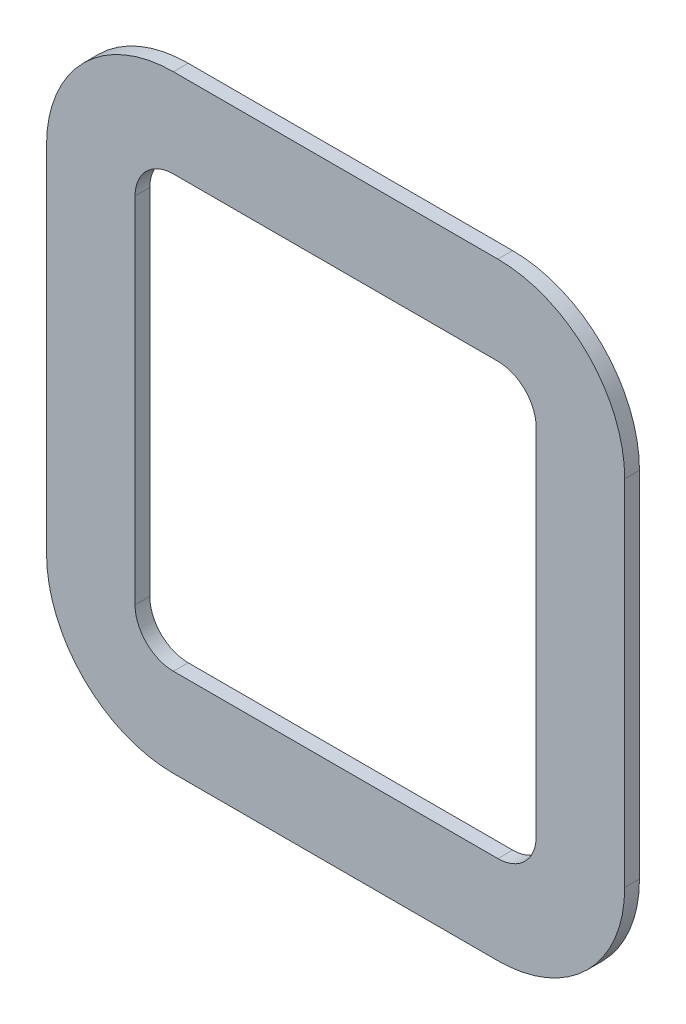
ISO-10303-21;
HEADER;
FILE_DESCRIPTION(('STEP AP214'),'2;1');
FILE_NAME('part.step','',(''),(''),'','','');
FILE_SCHEMA(('AUTOMOTIVE_DESIGN { 1 0 10303 214 1 1 1 1 }'));
ENDSEC;
DATA;
#1=APPLICATION_CONTEXT('core data for automotive mechanical design processes');
#2=APPLICATION_PROTOCOL_DEFINITION('international standard','automotive_design',2000,#1);
#3=PRODUCT_CONTEXT('',#1,'mechanical');
#4=PRODUCT('Part','Part','',(#3));
#5=PRODUCT_RELATED_PRODUCT_CATEGORY('part','',(#4));
#6=PRODUCT_DEFINITION_FORMATION('','',#4);
#7=PRODUCT_DEFINITION_CONTEXT('part definition',#1,'design');
#8=PRODUCT_DEFINITION('design','',#6,#7);
#9=PRODUCT_DEFINITION_SHAPE('','',#8);
#10=(LENGTH_UNIT() NAMED_UNIT(*) SI_UNIT(.MILLI.,.METRE.));
#11=(NAMED_UNIT(*) PLANE_ANGLE_UNIT() SI_UNIT($,.RADIAN.));
#12=(NAMED_UNIT(*) SI_UNIT($,.STERADIAN.) SOLID_ANGLE_UNIT());
#13=UNCERTAINTY_MEASURE_WITH_UNIT(LENGTH_MEASURE(1.E-05),#10,'distance_accuracy_value','');
#14=(GEOMETRIC_REPRESENTATION_CONTEXT(3) GLOBAL_UNCERTAINTY_ASSIGNED_CONTEXT((#13)) GLOBAL_UNIT_ASSIGNED_CONTEXT((#10,
#11,#12)) REPRESENTATION_CONTEXT('',''));
#15=CARTESIAN_POINT('',(0.,0.,0.));
#16=DIRECTION('',(0.,0.,1.));
#17=DIRECTION('',(1.,0.,0.));
#18=AXIS2_PLACEMENT_3D('',#15,#16,#17);
#19=CARTESIAN_POINT('',(5.49999947552359,6.00000048082601,-0.5));
#20=DIRECTION('',(0.,0.,1.));
#21=DIRECTION('',(1.,0.,0.));
#22=AXIS2_PLACEMENT_3D('',#19,#20,#21);
#23=CYLINDRICAL_SURFACE('',#22,4.3);
#24=CARTESIAN_POINT('',(5.49999947552359,6.00000048082601,0.));
#25=DIRECTION('',(0.,0.,1.));
#26=DIRECTION('',(1.,0.,0.));
#27=AXIS2_PLACEMENT_3D('',#24,#25,#26);
#28=CIRCLE('',#27,4.3);
#29=CARTESIAN_POINT('',(9.7999994755236,6.00000048082601,0.));
#30=VERTEX_POINT('',#29);
#31=CARTESIAN_POINT('',(5.49999947552359,10.300000480826,0.));
#32=VERTEX_POINT('',#31);
#33=EDGE_CURVE('E207',#30,#32,#28,.T.);
#34=ORIENTED_EDGE('',*,*,#33,.F.);
#35=DIRECTION('',(0.,0.,1.));
#36=VECTOR('',#35,1.);
#37=CARTESIAN_POINT('',(9.7999994755236,6.00000048082601,-0.5));
#38=LINE('',#37,#36);
#39=CARTESIAN_POINT('',(9.7999994755236,6.00000048082601,-0.5));
#40=VERTEX_POINT('',#39);
#41=EDGE_CURVE('E11',#40,#30,#38,.T.);
#42=ORIENTED_EDGE('',*,*,#41,.F.);
#43=CARTESIAN_POINT('',(5.49999947552359,6.00000048082601,-0.5));
#44=DIRECTION('',(0.,0.,1.));
#45=DIRECTION('',(1.,0.,0.));
#46=AXIS2_PLACEMENT_3D('',#43,#44,#45);
#47=CIRCLE('',#46,4.3);
#48=CARTESIAN_POINT('',(5.49999947552359,10.300000480826,-0.5));
#49=VERTEX_POINT('',#48);
#50=EDGE_CURVE('E219',#40,#49,#47,.T.);
#51=ORIENTED_EDGE('',*,*,#50,.T.);
#52=DIRECTION('',(0.,0.,1.));
#53=VECTOR('',#52,1.);
#54=CARTESIAN_POINT('',(5.49999947552359,10.300000480826,-0.5));
#55=LINE('',#54,#53);
#56=EDGE_CURVE('E40',#49,#32,#55,.T.);
#57=ORIENTED_EDGE('',*,*,#56,.T.);
#58=EDGE_LOOP('',(#34,#42,#51,#57));
#59=FACE_BOUND('',#58,.T.);
#60=ADVANCED_FACE('F37',(#59),#23,.T.);
#61=CARTESIAN_POINT('',(9.7999994755236,6.00000048082601,-0.5));
#62=DIRECTION('',(1.,0.,0.));
#63=DIRECTION('',(0.,0.,-1.));
#64=AXIS2_PLACEMENT_3D('',#61,#62,#63);
#65=PLANE('',#64);
#66=DIRECTION('',(0.,1.,0.));
#67=VECTOR('',#66,1.);
#68=CARTESIAN_POINT('',(9.7999994755236,6.00000048082601,0.));
#69=LINE('',#68,#67);
#70=CARTESIAN_POINT('',(9.7999994755236,-6.000000480824,0.));
#71=VERTEX_POINT('',#70);
#72=EDGE_CURVE('E223',#71,#30,#69,.T.);
#73=ORIENTED_EDGE('',*,*,#72,.F.);
#74=DIRECTION('',(0.,0.,1.));
#75=VECTOR('',#74,1.);
#76=CARTESIAN_POINT('',(9.7999994755236,-6.000000480824,-0.5));
#77=LINE('',#76,#75);
#78=CARTESIAN_POINT('',(9.7999994755236,-6.000000480824,-0.5));
#79=VERTEX_POINT('',#78);
#80=EDGE_CURVE('E45',#79,#71,#77,.T.);
#81=ORIENTED_EDGE('',*,*,#80,.F.);
#82=DIRECTION('',(0.,1.,0.));
#83=VECTOR('',#82,1.);
#84=CARTESIAN_POINT('',(9.7999994755236,6.00000048082601,-0.5));
#85=LINE('',#84,#83);
#86=EDGE_CURVE('E241',#79,#40,#85,.T.);
#87=ORIENTED_EDGE('',*,*,#86,.T.);
#88=ORIENTED_EDGE('',*,*,#41,.T.);
#89=EDGE_LOOP('',(#73,#81,#87,#88));
#90=FACE_BOUND('',#89,.T.);
#91=ADVANCED_FACE('F288',(#90),#65,.T.);
#92=CARTESIAN_POINT('',(5.4999994755236,-6.000000480824,-0.5));
#93=DIRECTION('',(0.,0.,1.));
#94=DIRECTION('',(1.,0.,0.));
#95=AXIS2_PLACEMENT_3D('',#92,#93,#94);
#96=CYLINDRICAL_SURFACE('',#95,4.3);
#97=CARTESIAN_POINT('',(5.4999994755236,-6.000000480824,0.));
#98=DIRECTION('',(0.,0.,1.));
#99=DIRECTION('',(-1.,0.,0.));
#100=AXIS2_PLACEMENT_3D('',#97,#98,#99);
#101=CIRCLE('',#100,4.3);
#102=CARTESIAN_POINT('',(5.4999994755236,-10.300000480824,0.));
#103=VERTEX_POINT('',#102);
#104=EDGE_CURVE('E261',#103,#71,#101,.T.);
#105=ORIENTED_EDGE('',*,*,#104,.F.);
#106=DIRECTION('',(0.,0.,1.));
#107=VECTOR('',#106,1.);
#108=CARTESIAN_POINT('',(5.4999994755236,-10.300000480824,-0.5));
#109=LINE('',#108,#107);
#110=CARTESIAN_POINT('',(5.4999994755236,-10.300000480824,-0.5));
#111=VERTEX_POINT('',#110);
#112=EDGE_CURVE('E267',#111,#103,#109,.T.);
#113=ORIENTED_EDGE('',*,*,#112,.F.);
#114=CARTESIAN_POINT('',(5.4999994755236,-6.000000480824,-0.5));
#115=DIRECTION('',(0.,0.,1.));
#116=DIRECTION('',(-1.,0.,0.));
#117=AXIS2_PLACEMENT_3D('',#114,#115,#116);
#118=CIRCLE('',#117,4.3);
#119=EDGE_CURVE('E238',#111,#79,#118,.T.);
#120=ORIENTED_EDGE('',*,*,#119,.T.);
#121=ORIENTED_EDGE('',*,*,#80,.T.);
#122=EDGE_LOOP('',(#105,#113,#120,#121));
#123=FACE_BOUND('',#122,.T.);
#124=ADVANCED_FACE('F307',(#123),#96,.T.);
#125=CARTESIAN_POINT('',(5.4999994755236,-10.300000480824,-0.5));
#126=DIRECTION('',(0.,-1.,0.));
#127=DIRECTION('',(0.,0.,-1.));
#128=AXIS2_PLACEMENT_3D('',#125,#126,#127);
#129=PLANE('',#128);
#130=DIRECTION('',(1.,0.,0.));
#131=VECTOR('',#130,1.);
#132=CARTESIAN_POINT('',(5.4999994755236,-10.300000480824,0.));
#133=LINE('',#132,#131);
#134=CARTESIAN_POINT('',(-5.50000052447635,-10.300000480824,0.));
#135=VERTEX_POINT('',#134);
#136=EDGE_CURVE('E258',#135,#103,#133,.T.);
#137=ORIENTED_EDGE('',*,*,#136,.F.);
#138=DIRECTION('',(0.,0.,1.));
#139=VECTOR('',#138,1.);
#140=CARTESIAN_POINT('',(-5.50000052447635,-10.300000480824,-0.5));
#141=LINE('',#140,#139);
#142=CARTESIAN_POINT('',(-5.50000052447635,-10.300000480824,-0.5));
#143=VERTEX_POINT('',#142);
#144=EDGE_CURVE('E269',#143,#135,#141,.T.);
#145=ORIENTED_EDGE('',*,*,#144,.F.);
#146=DIRECTION('',(1.,0.,0.));
#147=VECTOR('',#146,1.);
#148=CARTESIAN_POINT('',(5.4999994755236,-10.300000480824,-0.5));
#149=LINE('',#148,#147);
#150=EDGE_CURVE('E235',#143,#111,#149,.T.);
#151=ORIENTED_EDGE('',*,*,#150,.T.);
#152=ORIENTED_EDGE('',*,*,#112,.T.);
#153=EDGE_LOOP('',(#137,#145,#151,#152));
#154=FACE_BOUND('',#153,.T.);
#155=ADVANCED_FACE('F305',(#154),#129,.T.);
#156=CARTESIAN_POINT('',(-5.50000052447635,-6.000000480824,-0.5));
#157=DIRECTION('',(0.,0.,1.));
#158=DIRECTION('',(1.,0.,0.));
#159=AXIS2_PLACEMENT_3D('',#156,#157,#158);
#160=CYLINDRICAL_SURFACE('',#159,4.3);
#161=CARTESIAN_POINT('',(-5.50000052447635,-6.000000480824,0.));
#162=DIRECTION('',(0.,0.,1.));
#163=DIRECTION('',(-1.,0.,0.));
#164=AXIS2_PLACEMENT_3D('',#161,#162,#163);
#165=CIRCLE('',#164,4.3);
#166=CARTESIAN_POINT('',(-9.80000052447635,-6.000000480824,0.));
#167=VERTEX_POINT('',#166);
#168=EDGE_CURVE('E255',#167,#135,#165,.T.);
#169=ORIENTED_EDGE('',*,*,#168,.F.);
#170=DIRECTION('',(0.,0.,1.));
#171=VECTOR('',#170,1.);
#172=CARTESIAN_POINT('',(-9.80000052447635,-6.000000480824,-0.5));
#173=LINE('',#172,#171);
#174=CARTESIAN_POINT('',(-9.80000052447635,-6.000000480824,-0.5));
#175=VERTEX_POINT('',#174);
#176=EDGE_CURVE('E271',#175,#167,#173,.T.);
#177=ORIENTED_EDGE('',*,*,#176,.F.);
#178=CARTESIAN_POINT('',(-5.50000052447635,-6.000000480824,-0.5));
#179=DIRECTION('',(0.,0.,1.));
#180=DIRECTION('',(-1.,0.,0.));
#181=AXIS2_PLACEMENT_3D('',#178,#179,#180);
#182=CIRCLE('',#181,4.3);
#183=EDGE_CURVE('E232',#175,#143,#182,.T.);
#184=ORIENTED_EDGE('',*,*,#183,.T.);
#185=ORIENTED_EDGE('',*,*,#144,.T.);
#186=EDGE_LOOP('',(#169,#177,#184,#185));
#187=FACE_BOUND('',#186,.T.);
#188=ADVANCED_FACE('F301',(#187),#160,.T.);
#189=CARTESIAN_POINT('',(-9.80000052447635,6.00000048082601,-0.5));
#190=DIRECTION('',(-1.,0.,0.));
#191=DIRECTION('',(0.,0.,1.));
#192=AXIS2_PLACEMENT_3D('',#189,#190,#191);
#193=PLANE('',#192);
#194=DIRECTION('',(0.,-1.,0.));
#195=VECTOR('',#194,1.);
#196=CARTESIAN_POINT('',(-9.80000052447635,6.00000048082601,0.));
#197=LINE('',#196,#195);
#198=CARTESIAN_POINT('',(-9.80000052447635,6.00000048082601,0.));
#199=VERTEX_POINT('',#198);
#200=EDGE_CURVE('E252',#199,#167,#197,.T.);
#201=ORIENTED_EDGE('',*,*,#200,.F.);
#202=DIRECTION('',(0.,0.,1.));
#203=VECTOR('',#202,1.);
#204=CARTESIAN_POINT('',(-9.80000052447635,6.00000048082601,-0.5));
#205=LINE('',#204,#203);
#206=CARTESIAN_POINT('',(-9.80000052447635,6.00000048082601,-0.5));
#207=VERTEX_POINT('',#206);
#208=EDGE_CURVE('E273',#207,#199,#205,.T.);
#209=ORIENTED_EDGE('',*,*,#208,.F.);
#210=DIRECTION('',(0.,-1.,0.));
#211=VECTOR('',#210,1.);
#212=CARTESIAN_POINT('',(-9.80000052447635,6.00000048082601,-0.5));
#213=LINE('',#212,#211);
#214=EDGE_CURVE('E229',#207,#175,#213,.T.);
#215=ORIENTED_EDGE('',*,*,#214,.T.);
#216=ORIENTED_EDGE('',*,*,#176,.T.);
#217=EDGE_LOOP('',(#201,#209,#215,#216));
#218=FACE_BOUND('',#217,.T.);
#219=ADVANCED_FACE('F299',(#218),#193,.T.);
#220=CARTESIAN_POINT('',(-5.50000052447636,6.00000048082601,-0.5));
#221=DIRECTION('',(0.,0.,1.));
#222=DIRECTION('',(1.,0.,0.));
#223=AXIS2_PLACEMENT_3D('',#220,#221,#222);
#224=CYLINDRICAL_SURFACE('',#223,4.3);
#225=CARTESIAN_POINT('',(-5.50000052447636,6.00000048082601,0.));
#226=DIRECTION('',(0.,0.,1.));
#227=DIRECTION('',(-1.,0.,0.));
#228=AXIS2_PLACEMENT_3D('',#225,#226,#227);
#229=CIRCLE('',#228,4.3);
#230=CARTESIAN_POINT('',(-5.50000052447635,10.300000480826,0.));
#231=VERTEX_POINT('',#230);
#232=EDGE_CURVE('E249',#231,#199,#229,.T.);
#233=ORIENTED_EDGE('',*,*,#232,.F.);
#234=DIRECTION('',(0.,0.,1.));
#235=VECTOR('',#234,1.);
#236=CARTESIAN_POINT('',(-5.50000052447635,10.300000480826,-0.5));
#237=LINE('',#236,#235);
#238=CARTESIAN_POINT('',(-5.50000052447635,10.300000480826,-0.5));
#239=VERTEX_POINT('',#238);
#240=EDGE_CURVE('E274',#239,#231,#237,.T.);
#241=ORIENTED_EDGE('',*,*,#240,.F.);
#242=CARTESIAN_POINT('',(-5.50000052447636,6.00000048082601,-0.5));
#243=DIRECTION('',(0.,0.,1.));
#244=DIRECTION('',(-1.,0.,0.));
#245=AXIS2_PLACEMENT_3D('',#242,#243,#244);
#246=CIRCLE('',#245,4.3);
#247=EDGE_CURVE('E226',#239,#207,#246,.T.);
#248=ORIENTED_EDGE('',*,*,#247,.T.);
#249=ORIENTED_EDGE('',*,*,#208,.T.);
#250=EDGE_LOOP('',(#233,#241,#248,#249));
#251=FACE_BOUND('',#250,.T.);
#252=ADVANCED_FACE('F295',(#251),#224,.T.);
#253=CARTESIAN_POINT('',(5.49999947552359,10.300000480826,-0.5));
#254=DIRECTION('',(0.,1.,0.));
#255=DIRECTION('',(0.,0.,1.));
#256=AXIS2_PLACEMENT_3D('',#253,#254,#255);
#257=PLANE('',#256);
#258=DIRECTION('',(-1.,0.,0.));
#259=VECTOR('',#258,1.);
#260=CARTESIAN_POINT('',(5.49999947552359,10.300000480826,0.));
#261=LINE('',#260,#259);
#262=EDGE_CURVE('E246',#32,#231,#261,.T.);
#263=ORIENTED_EDGE('',*,*,#262,.F.);
#264=ORIENTED_EDGE('',*,*,#56,.F.);
#265=DIRECTION('',(-1.,0.,0.));
#266=VECTOR('',#265,1.);
#267=CARTESIAN_POINT('',(5.49999947552359,10.300000480826,-0.5));
#268=LINE('',#267,#266);
#269=EDGE_CURVE('E222',#49,#239,#268,.T.);
#270=ORIENTED_EDGE('',*,*,#269,.T.);
#271=ORIENTED_EDGE('',*,*,#240,.T.);
#272=EDGE_LOOP('',(#263,#264,#270,#271));
#273=FACE_BOUND('',#272,.T.);
#274=ADVANCED_FACE('F282',(#273),#257,.T.);
#275=CARTESIAN_POINT('',(5.49999947552359,6.00000048082601,-0.5));
#276=DIRECTION('',(0.,0.,1.));
#277=DIRECTION('',(1.,0.,0.));
#278=AXIS2_PLACEMENT_3D('',#275,#276,#277);
#279=PLANE('',#278);
#280=DIRECTION('',(0.,1.,0.));
#281=VECTOR('',#280,1.);
#282=CARTESIAN_POINT('',(6.7999994755236,6.00000048082601,-0.5));
#283=LINE('',#282,#281);
#284=CARTESIAN_POINT('',(6.7999994755236,-6.000000480824,-0.5));
#285=VERTEX_POINT('',#284);
#286=CARTESIAN_POINT('',(6.7999994755236,6.00000048082601,-0.5));
#287=VERTEX_POINT('',#286);
#288=EDGE_CURVE('E158',#285,#287,#283,.T.);
#289=ORIENTED_EDGE('',*,*,#288,.T.);
#290=CARTESIAN_POINT('',(5.49999947552359,6.00000048082601,-0.5));
#291=DIRECTION('',(0.,0.,1.));
#292=DIRECTION('',(1.,0.,0.));
#293=AXIS2_PLACEMENT_3D('',#290,#291,#292);
#294=CIRCLE('',#293,1.3);
#295=CARTESIAN_POINT('',(5.49999947552359,7.30000048082601,-0.5));
#296=VERTEX_POINT('',#295);
#297=EDGE_CURVE('E152',#287,#296,#294,.T.);
#298=ORIENTED_EDGE('',*,*,#297,.T.);
#299=DIRECTION('',(-1.,0.,0.));
#300=VECTOR('',#299,1.);
#301=CARTESIAN_POINT('',(5.49999947552359,7.30000048082601,-0.5));
#302=LINE('',#301,#300);
#303=CARTESIAN_POINT('',(-5.50000052447635,7.30000048082601,-0.5));
#304=VERTEX_POINT('',#303);
#305=EDGE_CURVE('E161',#296,#304,#302,.T.);
#306=ORIENTED_EDGE('',*,*,#305,.T.);
#307=CARTESIAN_POINT('',(-5.50000052447635,6.00000048082601,-0.5));
#308=DIRECTION('',(0.,0.,1.));
#309=DIRECTION('',(-1.,0.,0.));
#310=AXIS2_PLACEMENT_3D('',#307,#308,#309);
#311=CIRCLE('',#310,1.3);
#312=CARTESIAN_POINT('',(-6.80000052447635,6.00000048082601,-0.5));
#313=VERTEX_POINT('',#312);
#314=EDGE_CURVE('E53',#304,#313,#311,.T.);
#315=ORIENTED_EDGE('',*,*,#314,.T.);
#316=DIRECTION('',(0.,-1.,0.));
#317=VECTOR('',#316,1.);
#318=CARTESIAN_POINT('',(-6.80000052447635,6.00000048082601,-0.5));
#319=LINE('',#318,#317);
#320=CARTESIAN_POINT('',(-6.80000052447635,-6.000000480824,-0.5));
#321=VERTEX_POINT('',#320);
#322=EDGE_CURVE('E176',#313,#321,#319,.T.);
#323=ORIENTED_EDGE('',*,*,#322,.T.);
#324=CARTESIAN_POINT('',(-5.50000052447636,-6.000000480824,-0.5));
#325=DIRECTION('',(0.,0.,1.));
#326=DIRECTION('',(-1.,0.,0.));
#327=AXIS2_PLACEMENT_3D('',#324,#325,#326);
#328=CIRCLE('',#327,1.3);
#329=CARTESIAN_POINT('',(-5.50000052447636,-7.300000480824,-0.5));
#330=VERTEX_POINT('',#329);
#331=EDGE_CURVE('E179',#321,#330,#328,.T.);
#332=ORIENTED_EDGE('',*,*,#331,.T.);
#333=DIRECTION('',(1.,0.,0.));
#334=VECTOR('',#333,1.);
#335=CARTESIAN_POINT('',(5.4999994755236,-7.30000048082401,-0.5));
#336=LINE('',#335,#334);
#337=CARTESIAN_POINT('',(5.4999994755236,-7.30000048082401,-0.5));
#338=VERTEX_POINT('',#337);
#339=EDGE_CURVE('E182',#330,#338,#336,.T.);
#340=ORIENTED_EDGE('',*,*,#339,.T.);
#341=CARTESIAN_POINT('',(5.4999994755236,-6.000000480824,-0.5));
#342=DIRECTION('',(0.,0.,1.));
#343=DIRECTION('',(-1.,0.,0.));
#344=AXIS2_PLACEMENT_3D('',#341,#342,#343);
#345=CIRCLE('',#344,1.3);
#346=EDGE_CURVE('E185',#338,#285,#345,.T.);
#347=ORIENTED_EDGE('',*,*,#346,.T.);
#348=EDGE_LOOP('',(#289,#298,#306,#315,#323,#332,#340,#347));
#349=FACE_BOUND('',#348,.T.);
#350=ORIENTED_EDGE('',*,*,#50,.F.);
#351=ORIENTED_EDGE('',*,*,#86,.F.);
#352=ORIENTED_EDGE('',*,*,#119,.F.);
#353=ORIENTED_EDGE('',*,*,#150,.F.);
#354=ORIENTED_EDGE('',*,*,#183,.F.);
#355=ORIENTED_EDGE('',*,*,#214,.F.);
#356=ORIENTED_EDGE('',*,*,#247,.F.);
#357=ORIENTED_EDGE('',*,*,#269,.F.);
#358=EDGE_LOOP('',(#350,#351,#352,#353,#354,#355,#356,#357));
#359=FACE_BOUND('',#358,.T.);
#360=ADVANCED_FACE('F165',(#349,#359),#279,.F.);
#361=CARTESIAN_POINT('',(5.49999947552359,6.00000048082601,0.));
#362=DIRECTION('',(0.,0.,1.));
#363=DIRECTION('',(1.,0.,0.));
#364=AXIS2_PLACEMENT_3D('',#361,#362,#363);
#365=PLANE('',#364);
#366=CARTESIAN_POINT('',(5.49999947552359,6.00000048082601,0.));
#367=DIRECTION('',(0.,0.,1.));
#368=DIRECTION('',(1.,0.,0.));
#369=AXIS2_PLACEMENT_3D('',#366,#367,#368);
#370=CIRCLE('',#369,1.3);
#371=CARTESIAN_POINT('',(6.7999994755236,6.00000048082601,0.));
#372=VERTEX_POINT('',#371);
#373=CARTESIAN_POINT('',(5.49999947552359,7.30000048082601,0.));
#374=VERTEX_POINT('',#373);
#375=EDGE_CURVE('E61',#372,#374,#370,.T.);
#376=ORIENTED_EDGE('',*,*,#375,.F.);
#377=DIRECTION('',(0.,1.,0.));
#378=VECTOR('',#377,1.);
#379=CARTESIAN_POINT('',(6.7999994755236,6.00000048082601,0.));
#380=LINE('',#379,#378);
#381=CARTESIAN_POINT('',(6.7999994755236,-6.000000480824,0.));
#382=VERTEX_POINT('',#381);
#383=EDGE_CURVE('E169',#382,#372,#380,.T.);
#384=ORIENTED_EDGE('',*,*,#383,.F.);
#385=CARTESIAN_POINT('',(5.4999994755236,-6.000000480824,0.));
#386=DIRECTION('',(0.,0.,1.));
#387=DIRECTION('',(-1.,0.,0.));
#388=AXIS2_PLACEMENT_3D('',#385,#386,#387);
#389=CIRCLE('',#388,1.3);
#390=CARTESIAN_POINT('',(5.4999994755236,-7.30000048082401,0.));
#391=VERTEX_POINT('',#390);
#392=EDGE_CURVE('E172',#391,#382,#389,.T.);
#393=ORIENTED_EDGE('',*,*,#392,.F.);
#394=DIRECTION('',(1.,0.,0.));
#395=VECTOR('',#394,1.);
#396=CARTESIAN_POINT('',(5.4999994755236,-7.30000048082401,0.));
#397=LINE('',#396,#395);
#398=CARTESIAN_POINT('',(-5.50000052447636,-7.300000480824,0.));
#399=VERTEX_POINT('',#398);
#400=EDGE_CURVE('E200',#399,#391,#397,.T.);
#401=ORIENTED_EDGE('',*,*,#400,.F.);
#402=CARTESIAN_POINT('',(-5.50000052447636,-6.000000480824,0.));
#403=DIRECTION('',(0.,0.,1.));
#404=DIRECTION('',(-1.,0.,0.));
#405=AXIS2_PLACEMENT_3D('',#402,#403,#404);
#406=CIRCLE('',#405,1.3);
#407=CARTESIAN_POINT('',(-6.80000052447635,-6.000000480824,0.));
#408=VERTEX_POINT('',#407);
#409=EDGE_CURVE('E197',#408,#399,#406,.T.);
#410=ORIENTED_EDGE('',*,*,#409,.F.);
#411=DIRECTION('',(0.,-1.,0.));
#412=VECTOR('',#411,1.);
#413=CARTESIAN_POINT('',(-6.80000052447635,6.00000048082601,0.));
#414=LINE('',#413,#412);
#415=CARTESIAN_POINT('',(-6.80000052447635,6.00000048082601,0.));
#416=VERTEX_POINT('',#415);
#417=EDGE_CURVE('E194',#416,#408,#414,.T.);
#418=ORIENTED_EDGE('',*,*,#417,.F.);
#419=CARTESIAN_POINT('',(-5.50000052447635,6.00000048082601,0.));
#420=DIRECTION('',(0.,0.,1.));
#421=DIRECTION('',(-1.,0.,0.));
#422=AXIS2_PLACEMENT_3D('',#419,#420,#421);
#423=CIRCLE('',#422,1.3);
#424=CARTESIAN_POINT('',(-5.50000052447635,7.30000048082601,0.));
#425=VERTEX_POINT('',#424);
#426=EDGE_CURVE('E191',#425,#416,#423,.T.);
#427=ORIENTED_EDGE('',*,*,#426,.F.);
#428=DIRECTION('',(-1.,0.,0.));
#429=VECTOR('',#428,1.);
#430=CARTESIAN_POINT('',(5.49999947552359,7.30000048082601,0.));
#431=LINE('',#430,#429);
#432=EDGE_CURVE('E189',#374,#425,#431,.T.);
#433=ORIENTED_EDGE('',*,*,#432,.F.);
#434=EDGE_LOOP('',(#376,#384,#393,#401,#410,#418,#427,#433));
#435=FACE_BOUND('',#434,.T.);
#436=ORIENTED_EDGE('',*,*,#33,.T.);
#437=ORIENTED_EDGE('',*,*,#262,.T.);
#438=ORIENTED_EDGE('',*,*,#232,.T.);
#439=ORIENTED_EDGE('',*,*,#200,.T.);
#440=ORIENTED_EDGE('',*,*,#168,.T.);
#441=ORIENTED_EDGE('',*,*,#136,.T.);
#442=ORIENTED_EDGE('',*,*,#104,.T.);
#443=ORIENTED_EDGE('',*,*,#72,.T.);
#444=EDGE_LOOP('',(#436,#437,#438,#439,#440,#441,#442,#443));
#445=FACE_BOUND('',#444,.T.);
#446=ADVANCED_FACE('F284',(#435,#445),#365,.T.);
#447=CARTESIAN_POINT('',(5.49999947552359,6.00000048082601,-0.5));
#448=DIRECTION('',(0.,0.,1.));
#449=DIRECTION('',(1.,0.,0.));
#450=AXIS2_PLACEMENT_3D('',#447,#448,#449);
#451=CYLINDRICAL_SURFACE('',#450,1.3);
#452=ORIENTED_EDGE('',*,*,#375,.T.);
#453=DIRECTION('',(0.,0.,1.));
#454=VECTOR('',#453,1.);
#455=CARTESIAN_POINT('',(5.49999947552359,7.30000048082601,-0.5));
#456=LINE('',#455,#454);
#457=EDGE_CURVE('E148',#296,#374,#456,.T.);
#458=ORIENTED_EDGE('',*,*,#457,.F.);
#459=ORIENTED_EDGE('',*,*,#297,.F.);
#460=DIRECTION('',(0.,0.,1.));
#461=VECTOR('',#460,1.);
#462=CARTESIAN_POINT('',(6.7999994755236,6.00000048082601,-0.5));
#463=LINE('',#462,#461);
#464=EDGE_CURVE('E205',#287,#372,#463,.T.);
#465=ORIENTED_EDGE('',*,*,#464,.T.);
#466=EDGE_LOOP('',(#452,#458,#459,#465));
#467=FACE_BOUND('',#466,.T.);
#468=ADVANCED_FACE('F150',(#467),#451,.F.);
#469=CARTESIAN_POINT('',(6.7999994755236,6.00000048082601,-0.5));
#470=DIRECTION('',(1.,0.,0.));
#471=DIRECTION('',(0.,0.,-1.));
#472=AXIS2_PLACEMENT_3D('',#469,#470,#471);
#473=PLANE('',#472);
#474=ORIENTED_EDGE('',*,*,#383,.T.);
#475=ORIENTED_EDGE('',*,*,#464,.F.);
#476=ORIENTED_EDGE('',*,*,#288,.F.);
#477=DIRECTION('',(0.,0.,1.));
#478=VECTOR('',#477,1.);
#479=CARTESIAN_POINT('',(6.7999994755236,-6.000000480824,-0.5));
#480=LINE('',#479,#478);
#481=EDGE_CURVE('E208',#285,#382,#480,.T.);
#482=ORIENTED_EDGE('',*,*,#481,.T.);
#483=EDGE_LOOP('',(#474,#475,#476,#482));
#484=FACE_BOUND('',#483,.T.);
#485=ADVANCED_FACE('F390',(#484),#473,.F.);
#486=CARTESIAN_POINT('',(5.4999994755236,-6.000000480824,-0.5));
#487=DIRECTION('',(0.,0.,1.));
#488=DIRECTION('',(1.,0.,0.));
#489=AXIS2_PLACEMENT_3D('',#486,#487,#488);
#490=CYLINDRICAL_SURFACE('',#489,1.3);
#491=ORIENTED_EDGE('',*,*,#392,.T.);
#492=ORIENTED_EDGE('',*,*,#481,.F.);
#493=ORIENTED_EDGE('',*,*,#346,.F.);
#494=DIRECTION('',(0.,0.,1.));
#495=VECTOR('',#494,1.);
#496=CARTESIAN_POINT('',(5.4999994755236,-7.30000048082401,-0.5));
#497=LINE('',#496,#495);
#498=EDGE_CURVE('E210',#338,#391,#497,.T.);
#499=ORIENTED_EDGE('',*,*,#498,.T.);
#500=EDGE_LOOP('',(#491,#492,#493,#499));
#501=FACE_BOUND('',#500,.T.);
#502=ADVANCED_FACE('F399',(#501),#490,.F.);
#503=CARTESIAN_POINT('',(5.4999994755236,-7.30000048082401,-0.5));
#504=DIRECTION('',(0.,-1.,0.));
#505=DIRECTION('',(0.,0.,-1.));
#506=AXIS2_PLACEMENT_3D('',#503,#504,#505);
#507=PLANE('',#506);
#508=ORIENTED_EDGE('',*,*,#400,.T.);
#509=ORIENTED_EDGE('',*,*,#498,.F.);
#510=ORIENTED_EDGE('',*,*,#339,.F.);
#511=DIRECTION('',(0.,0.,1.));
#512=VECTOR('',#511,1.);
#513=CARTESIAN_POINT('',(-5.50000052447636,-7.300000480824,-0.5));
#514=LINE('',#513,#512);
#515=EDGE_CURVE('E212',#330,#399,#514,.T.);
#516=ORIENTED_EDGE('',*,*,#515,.T.);
#517=EDGE_LOOP('',(#508,#509,#510,#516));
#518=FACE_BOUND('',#517,.T.);
#519=ADVANCED_FACE('F409',(#518),#507,.F.);
#520=CARTESIAN_POINT('',(-5.50000052447636,-6.000000480824,-0.5));
#521=DIRECTION('',(0.,0.,1.));
#522=DIRECTION('',(1.,0.,0.));
#523=AXIS2_PLACEMENT_3D('',#520,#521,#522);
#524=CYLINDRICAL_SURFACE('',#523,1.3);
#525=ORIENTED_EDGE('',*,*,#409,.T.);
#526=ORIENTED_EDGE('',*,*,#515,.F.);
#527=ORIENTED_EDGE('',*,*,#331,.F.);
#528=DIRECTION('',(0.,0.,1.));
#529=VECTOR('',#528,1.);
#530=CARTESIAN_POINT('',(-6.80000052447635,-6.000000480824,-0.5));
#531=LINE('',#530,#529);
#532=EDGE_CURVE('E214',#321,#408,#531,.T.);
#533=ORIENTED_EDGE('',*,*,#532,.T.);
#534=EDGE_LOOP('',(#525,#526,#527,#533));
#535=FACE_BOUND('',#534,.T.);
#536=ADVANCED_FACE('F419',(#535),#524,.F.);
#537=CARTESIAN_POINT('',(-6.80000052447635,6.00000048082601,-0.5));
#538=DIRECTION('',(-1.,0.,0.));
#539=DIRECTION('',(0.,0.,1.));
#540=AXIS2_PLACEMENT_3D('',#537,#538,#539);
#541=PLANE('',#540);
#542=ORIENTED_EDGE('',*,*,#417,.T.);
#543=ORIENTED_EDGE('',*,*,#532,.F.);
#544=ORIENTED_EDGE('',*,*,#322,.F.);
#545=DIRECTION('',(0.,0.,1.));
#546=VECTOR('',#545,1.);
#547=CARTESIAN_POINT('',(-6.80000052447635,6.00000048082601,-0.5));
#548=LINE('',#547,#546);
#549=EDGE_CURVE('E216',#313,#416,#548,.T.);
#550=ORIENTED_EDGE('',*,*,#549,.T.);
#551=EDGE_LOOP('',(#542,#543,#544,#550));
#552=FACE_BOUND('',#551,.T.);
#553=ADVANCED_FACE('F429',(#552),#541,.F.);
#554=CARTESIAN_POINT('',(-5.50000052447635,6.00000048082601,-0.5));
#555=DIRECTION('',(0.,0.,1.));
#556=DIRECTION('',(1.,0.,0.));
#557=AXIS2_PLACEMENT_3D('',#554,#555,#556);
#558=CYLINDRICAL_SURFACE('',#557,1.3);
#559=ORIENTED_EDGE('',*,*,#426,.T.);
#560=ORIENTED_EDGE('',*,*,#549,.F.);
#561=ORIENTED_EDGE('',*,*,#314,.F.);
#562=DIRECTION('',(0.,0.,1.));
#563=VECTOR('',#562,1.);
#564=CARTESIAN_POINT('',(-5.50000052447635,7.30000048082601,-0.5));
#565=LINE('',#564,#563);
#566=EDGE_CURVE('E157',#304,#425,#565,.T.);
#567=ORIENTED_EDGE('',*,*,#566,.T.);
#568=EDGE_LOOP('',(#559,#560,#561,#567));
#569=FACE_BOUND('',#568,.T.);
#570=ADVANCED_FACE('F439',(#569),#558,.F.);
#571=CARTESIAN_POINT('',(5.49999947552359,7.30000048082601,-0.5));
#572=DIRECTION('',(0.,1.,0.));
#573=DIRECTION('',(0.,0.,1.));
#574=AXIS2_PLACEMENT_3D('',#571,#572,#573);
#575=PLANE('',#574);
#576=ORIENTED_EDGE('',*,*,#432,.T.);
#577=ORIENTED_EDGE('',*,*,#566,.F.);
#578=ORIENTED_EDGE('',*,*,#305,.F.);
#579=ORIENTED_EDGE('',*,*,#457,.T.);
#580=EDGE_LOOP('',(#576,#577,#578,#579));
#581=FACE_BOUND('',#580,.T.);
#582=ADVANCED_FACE('F162',(#581),#575,.F.);
#583=CLOSED_SHELL('',(#60,#91,#124,#155,#188,#219,#252,#274,#360,#446,#468,#485,#502,#519,#536,
#553,#570,#582));
#584=MANIFOLD_SOLID_BREP('B2',#583);
#585=ADVANCED_BREP_SHAPE_REPRESENTATION('',(#18,#584),#14);
#586=SHAPE_DEFINITION_REPRESENTATION(#9,#585);
ENDSEC;
END-ISO-10303-21;
